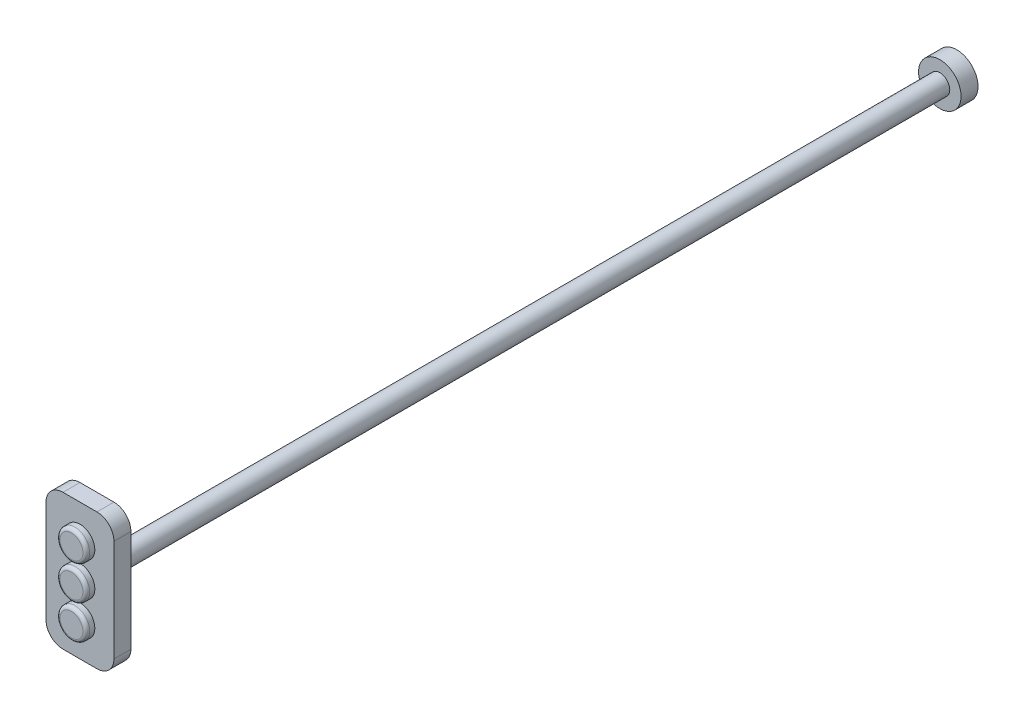
ISO-10303-21;
HEADER;
FILE_DESCRIPTION(('STEP AP214'),'2;1');
FILE_NAME('part.step','',(''),(''),'','','');
FILE_SCHEMA(('AUTOMOTIVE_DESIGN { 1 0 10303 214 1 1 1 1 }'));
ENDSEC;
DATA;
#1=APPLICATION_CONTEXT('core data for automotive mechanical design processes');
#2=APPLICATION_PROTOCOL_DEFINITION('international standard','automotive_design',2000,#1);
#3=PRODUCT_CONTEXT('',#1,'mechanical');
#4=PRODUCT('Part','Part','',(#3));
#5=PRODUCT_RELATED_PRODUCT_CATEGORY('part','',(#4));
#6=PRODUCT_DEFINITION_FORMATION('','',#4);
#7=PRODUCT_DEFINITION_CONTEXT('part definition',#1,'design');
#8=PRODUCT_DEFINITION('design','',#6,#7);
#9=PRODUCT_DEFINITION_SHAPE('','',#8);
#10=(LENGTH_UNIT() NAMED_UNIT(*) SI_UNIT(.MILLI.,.METRE.));
#11=(NAMED_UNIT(*) PLANE_ANGLE_UNIT() SI_UNIT($,.RADIAN.));
#12=(NAMED_UNIT(*) SI_UNIT($,.STERADIAN.) SOLID_ANGLE_UNIT());
#13=UNCERTAINTY_MEASURE_WITH_UNIT(LENGTH_MEASURE(1.E-05),#10,'distance_accuracy_value','');
#14=(GEOMETRIC_REPRESENTATION_CONTEXT(3) GLOBAL_UNCERTAINTY_ASSIGNED_CONTEXT((#13)) GLOBAL_UNIT_ASSIGNED_CONTEXT((#10,
#11,#12)) REPRESENTATION_CONTEXT('',''));
#15=CARTESIAN_POINT('',(0.,0.,0.));
#16=DIRECTION('',(0.,0.,1.));
#17=DIRECTION('',(1.,0.,0.));
#18=AXIS2_PLACEMENT_3D('',#15,#16,#17);
#19=CARTESIAN_POINT('',(0.,0.,511.));
#20=DIRECTION('',(0.,0.,-1.));
#21=DIRECTION('',(-1.,0.,0.));
#22=AXIS2_PLACEMENT_3D('',#19,#20,#21);
#23=CYLINDRICAL_SURFACE('',#22,8.75);
#24=CARTESIAN_POINT('',(0.,0.,506.));
#25=DIRECTION('',(0.,0.,1.));
#26=DIRECTION('',(1.,0.,0.));
#27=AXIS2_PLACEMENT_3D('',#24,#25,#26);
#28=CIRCLE('',#27,8.75);
#29=CARTESIAN_POINT('',(8.75,0.,506.));
#30=VERTEX_POINT('',#29);
#31=EDGE_CURVE('E43',#30,#30,#28,.T.);
#32=ORIENTED_EDGE('',*,*,#31,.T.);
#33=EDGE_LOOP('',(#32));
#34=FACE_BOUND('',#33,.T.);
#35=CARTESIAN_POINT('',(0.,0.,509.));
#36=DIRECTION('',(0.,0.,1.));
#37=DIRECTION('',(1.,0.,0.));
#38=AXIS2_PLACEMENT_3D('',#35,#36,#37);
#39=CIRCLE('',#38,8.75);
#40=CARTESIAN_POINT('',(8.75,0.,509.));
#41=VERTEX_POINT('',#40);
#42=EDGE_CURVE('E11',#41,#41,#39,.F.);
#43=ORIENTED_EDGE('',*,*,#42,.T.);
#44=EDGE_LOOP('',(#43));
#45=FACE_BOUND('',#44,.T.);
#46=ADVANCED_FACE('F39',(#34,#45),#23,.T.);
#47=CARTESIAN_POINT('',(0.,0.,511.));
#48=DIRECTION('',(0.,0.,1.));
#49=DIRECTION('',(1.,0.,0.));
#50=AXIS2_PLACEMENT_3D('',#47,#48,#49);
#51=PLANE('',#50);
#52=CARTESIAN_POINT('',(0.,0.,511.));
#53=DIRECTION('',(0.,0.,1.));
#54=DIRECTION('',(1.,0.,0.));
#55=AXIS2_PLACEMENT_3D('',#52,#53,#54);
#56=CIRCLE('',#55,6.75);
#57=CARTESIAN_POINT('',(6.75,0.,511.));
#58=VERTEX_POINT('',#57);
#59=EDGE_CURVE('E50',#58,#58,#56,.T.);
#60=ORIENTED_EDGE('',*,*,#59,.T.);
#61=EDGE_LOOP('',(#60));
#62=FACE_BOUND('',#61,.T.);
#63=ADVANCED_FACE('F202',(#62),#51,.T.);
#64=CARTESIAN_POINT('',(0.,0.,509.));
#65=DIRECTION('',(0.,0.,1.));
#66=DIRECTION('',(1.,0.,0.));
#67=AXIS2_PLACEMENT_3D('',#64,#65,#66);
#68=TOROIDAL_SURFACE('',#67,6.75,2.);
#69=ORIENTED_EDGE('',*,*,#42,.F.);
#70=EDGE_LOOP('',(#69));
#71=FACE_BOUND('',#70,.T.);
#72=ORIENTED_EDGE('',*,*,#59,.F.);
#73=EDGE_LOOP('',(#72));
#74=FACE_BOUND('',#73,.T.);
#75=ADVANCED_FACE('F41',(#71,#74),#68,.T.);
#76=CARTESIAN_POINT('',(-20.,20.,506.));
#77=DIRECTION('',(1.,0.,0.));
#78=DIRECTION('',(0.,0.,-1.));
#79=AXIS2_PLACEMENT_3D('',#76,#77,#78);
#80=PLANE('',#79);
#81=DIRECTION('',(0.,-1.,0.));
#82=VECTOR('',#81,1.);
#83=CARTESIAN_POINT('',(-20.,20.,496.));
#84=LINE('',#83,#82);
#85=CARTESIAN_POINT('',(-20.,30.,496.));
#86=VERTEX_POINT('',#85);
#87=CARTESIAN_POINT('',(-20.,-30.,496.));
#88=VERTEX_POINT('',#87);
#89=EDGE_CURVE('E143',#86,#88,#84,.T.);
#90=ORIENTED_EDGE('',*,*,#89,.T.);
#91=DIRECTION('',(0.,0.,-1.));
#92=VECTOR('',#91,1.);
#93=CARTESIAN_POINT('',(-20.,-30.,506.));
#94=LINE('',#93,#92);
#95=CARTESIAN_POINT('',(-20.,-30.,506.));
#96=VERTEX_POINT('',#95);
#97=EDGE_CURVE('E185',#96,#88,#94,.T.);
#98=ORIENTED_EDGE('',*,*,#97,.F.);
#99=DIRECTION('',(0.,-1.,0.));
#100=VECTOR('',#99,1.);
#101=CARTESIAN_POINT('',(-20.,20.,506.));
#102=LINE('',#101,#100);
#103=CARTESIAN_POINT('',(-20.,30.,506.));
#104=VERTEX_POINT('',#103);
#105=EDGE_CURVE('E166',#104,#96,#102,.T.);
#106=ORIENTED_EDGE('',*,*,#105,.F.);
#107=DIRECTION('',(0.,0.,-1.));
#108=VECTOR('',#107,1.);
#109=CARTESIAN_POINT('',(-20.,30.,506.));
#110=LINE('',#109,#108);
#111=EDGE_CURVE('E139',#104,#86,#110,.T.);
#112=ORIENTED_EDGE('',*,*,#111,.T.);
#113=EDGE_LOOP('',(#90,#98,#106,#112));
#114=FACE_BOUND('',#113,.T.);
#115=ADVANCED_FACE('F205',(#114),#80,.F.);
#116=CARTESIAN_POINT('',(-10.,-30.,506.));
#117=DIRECTION('',(0.,0.,-1.));
#118=DIRECTION('',(-1.,0.,0.));
#119=AXIS2_PLACEMENT_3D('',#116,#117,#118);
#120=CYLINDRICAL_SURFACE('',#119,10.);
#121=CARTESIAN_POINT('',(-10.,-30.,496.));
#122=DIRECTION('',(0.,0.,1.));
#123=DIRECTION('',(1.,0.,0.));
#124=AXIS2_PLACEMENT_3D('',#121,#122,#123);
#125=CIRCLE('',#124,10.);
#126=CARTESIAN_POINT('',(-10.,-40.,496.));
#127=VERTEX_POINT('',#126);
#128=EDGE_CURVE('E147',#88,#127,#125,.T.);
#129=ORIENTED_EDGE('',*,*,#128,.T.);
#130=DIRECTION('',(0.,0.,-1.));
#131=VECTOR('',#130,1.);
#132=CARTESIAN_POINT('',(-10.,-40.,506.));
#133=LINE('',#132,#131);
#134=CARTESIAN_POINT('',(-10.,-40.,506.));
#135=VERTEX_POINT('',#134);
#136=EDGE_CURVE('E181',#135,#127,#133,.T.);
#137=ORIENTED_EDGE('',*,*,#136,.F.);
#138=CARTESIAN_POINT('',(-10.,-30.,506.));
#139=DIRECTION('',(0.,0.,1.));
#140=DIRECTION('',(1.,0.,0.));
#141=AXIS2_PLACEMENT_3D('',#138,#139,#140);
#142=CIRCLE('',#141,10.);
#143=EDGE_CURVE('E102',#96,#135,#142,.T.);
#144=ORIENTED_EDGE('',*,*,#143,.F.);
#145=ORIENTED_EDGE('',*,*,#97,.T.);
#146=EDGE_LOOP('',(#129,#137,#144,#145));
#147=FACE_BOUND('',#146,.T.);
#148=ADVANCED_FACE('F211',(#147),#120,.T.);
#149=CARTESIAN_POINT('',(0.,-40.,506.));
#150=DIRECTION('',(0.,1.,0.));
#151=DIRECTION('',(0.,0.,1.));
#152=AXIS2_PLACEMENT_3D('',#149,#150,#151);
#153=PLANE('',#152);
#154=DIRECTION('',(1.,0.,0.));
#155=VECTOR('',#154,1.);
#156=CARTESIAN_POINT('',(0.,-40.,496.));
#157=LINE('',#156,#155);
#158=CARTESIAN_POINT('',(10.,-40.,496.));
#159=VERTEX_POINT('',#158);
#160=EDGE_CURVE('E151',#127,#159,#157,.T.);
#161=ORIENTED_EDGE('',*,*,#160,.T.);
#162=DIRECTION('',(0.,0.,-1.));
#163=VECTOR('',#162,1.);
#164=CARTESIAN_POINT('',(10.,-40.,506.));
#165=LINE('',#164,#163);
#166=CARTESIAN_POINT('',(10.,-40.,506.));
#167=VERTEX_POINT('',#166);
#168=EDGE_CURVE('E177',#167,#159,#165,.T.);
#169=ORIENTED_EDGE('',*,*,#168,.F.);
#170=DIRECTION('',(1.,0.,0.));
#171=VECTOR('',#170,1.);
#172=CARTESIAN_POINT('',(0.,-40.,506.));
#173=LINE('',#172,#171);
#174=EDGE_CURVE('E272',#135,#167,#173,.T.);
#175=ORIENTED_EDGE('',*,*,#174,.F.);
#176=ORIENTED_EDGE('',*,*,#136,.T.);
#177=EDGE_LOOP('',(#161,#169,#175,#176));
#178=FACE_BOUND('',#177,.T.);
#179=ADVANCED_FACE('F262',(#178),#153,.F.);
#180=CARTESIAN_POINT('',(10.,-30.,506.));
#181=DIRECTION('',(0.,0.,-1.));
#182=DIRECTION('',(-1.,0.,0.));
#183=AXIS2_PLACEMENT_3D('',#180,#181,#182);
#184=CYLINDRICAL_SURFACE('',#183,10.);
#185=CARTESIAN_POINT('',(10.,-30.,496.));
#186=DIRECTION('',(0.,0.,1.));
#187=DIRECTION('',(1.,0.,0.));
#188=AXIS2_PLACEMENT_3D('',#185,#186,#187);
#189=CIRCLE('',#188,10.);
#190=CARTESIAN_POINT('',(20.,-30.,496.));
#191=VERTEX_POINT('',#190);
#192=EDGE_CURVE('E154',#159,#191,#189,.T.);
#193=ORIENTED_EDGE('',*,*,#192,.T.);
#194=DIRECTION('',(0.,0.,-1.));
#195=VECTOR('',#194,1.);
#196=CARTESIAN_POINT('',(20.,-30.,506.));
#197=LINE('',#196,#195);
#198=CARTESIAN_POINT('',(20.,-30.,506.));
#199=VERTEX_POINT('',#198);
#200=EDGE_CURVE('E173',#199,#191,#197,.T.);
#201=ORIENTED_EDGE('',*,*,#200,.F.);
#202=CARTESIAN_POINT('',(10.,-30.,506.));
#203=DIRECTION('',(0.,0.,1.));
#204=DIRECTION('',(1.,0.,0.));
#205=AXIS2_PLACEMENT_3D('',#202,#203,#204);
#206=CIRCLE('',#205,10.);
#207=EDGE_CURVE('E278',#167,#199,#206,.T.);
#208=ORIENTED_EDGE('',*,*,#207,.F.);
#209=ORIENTED_EDGE('',*,*,#168,.T.);
#210=EDGE_LOOP('',(#193,#201,#208,#209));
#211=FACE_BOUND('',#210,.T.);
#212=ADVANCED_FACE('F258',(#211),#184,.T.);
#213=CARTESIAN_POINT('',(20.,20.,506.));
#214=DIRECTION('',(-1.,0.,0.));
#215=DIRECTION('',(0.,-1.,0.));
#216=AXIS2_PLACEMENT_3D('',#213,#214,#215);
#217=PLANE('',#216);
#218=DIRECTION('',(0.,1.,0.));
#219=VECTOR('',#218,1.);
#220=CARTESIAN_POINT('',(20.,20.,496.));
#221=LINE('',#220,#219);
#222=CARTESIAN_POINT('',(20.,30.,496.));
#223=VERTEX_POINT('',#222);
#224=EDGE_CURVE('E157',#191,#223,#221,.T.);
#225=ORIENTED_EDGE('',*,*,#224,.T.);
#226=DIRECTION('',(0.,0.,-1.));
#227=VECTOR('',#226,1.);
#228=CARTESIAN_POINT('',(20.,30.,506.));
#229=LINE('',#228,#227);
#230=CARTESIAN_POINT('',(20.,30.,506.));
#231=VERTEX_POINT('',#230);
#232=EDGE_CURVE('E132',#231,#223,#229,.T.);
#233=ORIENTED_EDGE('',*,*,#232,.F.);
#234=DIRECTION('',(0.,1.,0.));
#235=VECTOR('',#234,1.);
#236=CARTESIAN_POINT('',(20.,20.,506.));
#237=LINE('',#236,#235);
#238=EDGE_CURVE('E121',#199,#231,#237,.T.);
#239=ORIENTED_EDGE('',*,*,#238,.F.);
#240=ORIENTED_EDGE('',*,*,#200,.T.);
#241=EDGE_LOOP('',(#225,#233,#239,#240));
#242=FACE_BOUND('',#241,.T.);
#243=ADVANCED_FACE('F255',(#242),#217,.F.);
#244=CARTESIAN_POINT('',(10.,30.,506.));
#245=DIRECTION('',(0.,0.,-1.));
#246=DIRECTION('',(-1.,0.,0.));
#247=AXIS2_PLACEMENT_3D('',#244,#245,#246);
#248=CYLINDRICAL_SURFACE('',#247,10.);
#249=CARTESIAN_POINT('',(10.,30.,496.));
#250=DIRECTION('',(0.,0.,1.));
#251=DIRECTION('',(1.,0.,0.));
#252=AXIS2_PLACEMENT_3D('',#249,#250,#251);
#253=CIRCLE('',#252,10.);
#254=CARTESIAN_POINT('',(10.,40.,496.));
#255=VERTEX_POINT('',#254);
#256=EDGE_CURVE('E130',#223,#255,#253,.T.);
#257=ORIENTED_EDGE('',*,*,#256,.T.);
#258=DIRECTION('',(0.,0.,-1.));
#259=VECTOR('',#258,1.);
#260=CARTESIAN_POINT('',(10.,40.,506.));
#261=LINE('',#260,#259);
#262=CARTESIAN_POINT('',(10.,40.,506.));
#263=VERTEX_POINT('',#262);
#264=EDGE_CURVE('E127',#263,#255,#261,.T.);
#265=ORIENTED_EDGE('',*,*,#264,.F.);
#266=CARTESIAN_POINT('',(10.,30.,506.));
#267=DIRECTION('',(0.,0.,1.));
#268=DIRECTION('',(1.,0.,0.));
#269=AXIS2_PLACEMENT_3D('',#266,#267,#268);
#270=CIRCLE('',#269,10.);
#271=EDGE_CURVE('E115',#231,#263,#270,.T.);
#272=ORIENTED_EDGE('',*,*,#271,.F.);
#273=ORIENTED_EDGE('',*,*,#232,.T.);
#274=EDGE_LOOP('',(#257,#265,#272,#273));
#275=FACE_BOUND('',#274,.T.);
#276=ADVANCED_FACE('F128',(#275),#248,.T.);
#277=CARTESIAN_POINT('',(0.,40.,506.));
#278=DIRECTION('',(0.,-1.,0.));
#279=DIRECTION('',(1.,0.,0.));
#280=AXIS2_PLACEMENT_3D('',#277,#278,#279);
#281=PLANE('',#280);
#282=DIRECTION('',(-1.,0.,0.));
#283=VECTOR('',#282,1.);
#284=CARTESIAN_POINT('',(0.,40.,496.));
#285=LINE('',#284,#283);
#286=CARTESIAN_POINT('',(-10.,40.,496.));
#287=VERTEX_POINT('',#286);
#288=EDGE_CURVE('E87',#255,#287,#285,.T.);
#289=ORIENTED_EDGE('',*,*,#288,.T.);
#290=DIRECTION('',(0.,0.,-1.));
#291=VECTOR('',#290,1.);
#292=CARTESIAN_POINT('',(-10.,40.,506.));
#293=LINE('',#292,#291);
#294=CARTESIAN_POINT('',(-10.,40.,506.));
#295=VERTEX_POINT('',#294);
#296=EDGE_CURVE('E133',#295,#287,#293,.T.);
#297=ORIENTED_EDGE('',*,*,#296,.F.);
#298=DIRECTION('',(-1.,0.,0.));
#299=VECTOR('',#298,1.);
#300=CARTESIAN_POINT('',(0.,40.,506.));
#301=LINE('',#300,#299);
#302=EDGE_CURVE('E119',#263,#295,#301,.T.);
#303=ORIENTED_EDGE('',*,*,#302,.F.);
#304=ORIENTED_EDGE('',*,*,#264,.T.);
#305=EDGE_LOOP('',(#289,#297,#303,#304));
#306=FACE_BOUND('',#305,.T.);
#307=ADVANCED_FACE('F135',(#306),#281,.F.);
#308=CARTESIAN_POINT('',(-10.,30.,506.));
#309=DIRECTION('',(0.,0.,-1.));
#310=DIRECTION('',(-1.,0.,0.));
#311=AXIS2_PLACEMENT_3D('',#308,#309,#310);
#312=CYLINDRICAL_SURFACE('',#311,10.);
#313=CARTESIAN_POINT('',(-10.,30.,496.));
#314=DIRECTION('',(0.,0.,1.));
#315=DIRECTION('',(1.,0.,0.));
#316=AXIS2_PLACEMENT_3D('',#313,#314,#315);
#317=CIRCLE('',#316,10.);
#318=EDGE_CURVE('E93',#287,#86,#317,.T.);
#319=ORIENTED_EDGE('',*,*,#318,.T.);
#320=ORIENTED_EDGE('',*,*,#111,.F.);
#321=CARTESIAN_POINT('',(-10.,30.,506.));
#322=DIRECTION('',(0.,0.,1.));
#323=DIRECTION('',(1.,0.,0.));
#324=AXIS2_PLACEMENT_3D('',#321,#322,#323);
#325=CIRCLE('',#324,10.);
#326=EDGE_CURVE('E58',#295,#104,#325,.T.);
#327=ORIENTED_EDGE('',*,*,#326,.F.);
#328=ORIENTED_EDGE('',*,*,#296,.T.);
#329=EDGE_LOOP('',(#319,#320,#327,#328));
#330=FACE_BOUND('',#329,.T.);
#331=ADVANCED_FACE('F234',(#330),#312,.T.);
#332=CARTESIAN_POINT('',(-10.,-30.,506.));
#333=DIRECTION('',(0.,0.,1.));
#334=DIRECTION('',(1.,0.,0.));
#335=AXIS2_PLACEMENT_3D('',#332,#333,#334);
#336=PLANE('',#335);
#337=CARTESIAN_POINT('',(5.58637014214901E-13,-20.,506.));
#338=DIRECTION('',(0.,0.,1.));
#339=DIRECTION('',(1.,0.,0.));
#340=AXIS2_PLACEMENT_3D('',#337,#338,#339);
#341=CIRCLE('',#340,8.75000000000001);
#342=CARTESIAN_POINT('',(8.75000000000056,-20.,506.));
#343=VERTEX_POINT('',#342);
#344=EDGE_CURVE('E299',#343,#343,#341,.F.);
#345=ORIENTED_EDGE('',*,*,#344,.T.);
#346=EDGE_LOOP('',(#345));
#347=FACE_BOUND('',#346,.T.);
#348=CARTESIAN_POINT('',(0.,20.,506.));
#349=DIRECTION('',(0.,0.,1.));
#350=DIRECTION('',(1.,0.,0.));
#351=AXIS2_PLACEMENT_3D('',#348,#349,#350);
#352=CIRCLE('',#351,8.75);
#353=CARTESIAN_POINT('',(8.75,20.,506.));
#354=VERTEX_POINT('',#353);
#355=EDGE_CURVE('E148',#354,#354,#352,.F.);
#356=ORIENTED_EDGE('',*,*,#355,.T.);
#357=EDGE_LOOP('',(#356));
#358=FACE_BOUND('',#357,.T.);
#359=ORIENTED_EDGE('',*,*,#31,.F.);
#360=EDGE_LOOP('',(#359));
#361=FACE_BOUND('',#360,.T.);
#362=ORIENTED_EDGE('',*,*,#105,.T.);
#363=ORIENTED_EDGE('',*,*,#143,.T.);
#364=ORIENTED_EDGE('',*,*,#174,.T.);
#365=ORIENTED_EDGE('',*,*,#207,.T.);
#366=ORIENTED_EDGE('',*,*,#238,.T.);
#367=ORIENTED_EDGE('',*,*,#271,.T.);
#368=ORIENTED_EDGE('',*,*,#302,.T.);
#369=ORIENTED_EDGE('',*,*,#326,.T.);
#370=EDGE_LOOP('',(#362,#363,#364,#365,#366,#367,#368,#369));
#371=FACE_BOUND('',#370,.T.);
#372=ADVANCED_FACE('F117',(#347,#358,#361,#371),#336,.T.);
#373=CARTESIAN_POINT('',(0.,0.,-0.3));
#374=DIRECTION('',(0.,0.,1.));
#375=DIRECTION('',(1.,0.,0.));
#376=AXIS2_PLACEMENT_3D('',#373,#374,#375);
#377=CYLINDRICAL_SURFACE('',#376,5.85);
#378=CARTESIAN_POINT('',(0.,0.,-0.3));
#379=DIRECTION('',(0.,0.,1.));
#380=DIRECTION('',(1.,0.,0.));
#381=AXIS2_PLACEMENT_3D('',#378,#379,#380);
#382=CIRCLE('',#381,5.85);
#383=CARTESIAN_POINT('',(5.85,0.,-0.3));
#384=VERTEX_POINT('',#383);
#385=EDGE_CURVE('E192',#384,#384,#382,.T.);
#386=ORIENTED_EDGE('',*,*,#385,.T.);
#387=EDGE_LOOP('',(#386));
#388=FACE_BOUND('',#387,.T.);
#389=CARTESIAN_POINT('',(0.,0.,496.));
#390=DIRECTION('',(0.,0.,1.));
#391=DIRECTION('',(1.,0.,0.));
#392=AXIS2_PLACEMENT_3D('',#389,#390,#391);
#393=CIRCLE('',#392,5.85);
#394=CARTESIAN_POINT('',(5.85,0.,496.));
#395=VERTEX_POINT('',#394);
#396=EDGE_CURVE('E188',#395,#395,#393,.T.);
#397=ORIENTED_EDGE('',*,*,#396,.F.);
#398=EDGE_LOOP('',(#397));
#399=FACE_BOUND('',#398,.T.);
#400=ADVANCED_FACE('F225',(#388,#399),#377,.T.);
#401=CARTESIAN_POINT('',(0.,0.,496.));
#402=DIRECTION('',(0.,0.,1.));
#403=DIRECTION('',(1.,0.,0.));
#404=AXIS2_PLACEMENT_3D('',#401,#402,#403);
#405=PLANE('',#404);
#406=ORIENTED_EDGE('',*,*,#396,.T.);
#407=EDGE_LOOP('',(#406));
#408=FACE_BOUND('',#407,.T.);
#409=ORIENTED_EDGE('',*,*,#89,.F.);
#410=ORIENTED_EDGE('',*,*,#318,.F.);
#411=ORIENTED_EDGE('',*,*,#288,.F.);
#412=ORIENTED_EDGE('',*,*,#256,.F.);
#413=ORIENTED_EDGE('',*,*,#224,.F.);
#414=ORIENTED_EDGE('',*,*,#192,.F.);
#415=ORIENTED_EDGE('',*,*,#160,.F.);
#416=ORIENTED_EDGE('',*,*,#128,.F.);
#417=EDGE_LOOP('',(#409,#410,#411,#412,#413,#414,#415,#416));
#418=FACE_BOUND('',#417,.T.);
#419=ADVANCED_FACE('F224',(#408,#418),#405,.F.);
#420=CARTESIAN_POINT('',(0.,20.,511.));
#421=DIRECTION('',(0.,0.,-1.));
#422=DIRECTION('',(-1.,0.,0.));
#423=AXIS2_PLACEMENT_3D('',#420,#421,#422);
#424=CYLINDRICAL_SURFACE('',#423,8.75);
#425=ORIENTED_EDGE('',*,*,#355,.F.);
#426=EDGE_LOOP('',(#425));
#427=FACE_BOUND('',#426,.T.);
#428=CARTESIAN_POINT('',(0.,20.,509.));
#429=DIRECTION('',(0.,0.,1.));
#430=DIRECTION('',(1.,0.,0.));
#431=AXIS2_PLACEMENT_3D('',#428,#429,#430);
#432=CIRCLE('',#431,8.75);
#433=CARTESIAN_POINT('',(8.75,20.,509.));
#434=VERTEX_POINT('',#433);
#435=EDGE_CURVE('E291',#434,#434,#432,.F.);
#436=ORIENTED_EDGE('',*,*,#435,.T.);
#437=EDGE_LOOP('',(#436));
#438=FACE_BOUND('',#437,.T.);
#439=ADVANCED_FACE('F232',(#427,#438),#424,.T.);
#440=CARTESIAN_POINT('',(0.,20.,511.));
#441=DIRECTION('',(0.,0.,1.));
#442=DIRECTION('',(1.,0.,0.));
#443=AXIS2_PLACEMENT_3D('',#440,#441,#442);
#444=PLANE('',#443);
#445=CARTESIAN_POINT('',(0.,20.,511.));
#446=DIRECTION('',(0.,0.,1.));
#447=DIRECTION('',(1.,0.,0.));
#448=AXIS2_PLACEMENT_3D('',#445,#446,#447);
#449=CIRCLE('',#448,6.75);
#450=CARTESIAN_POINT('',(6.75,20.,511.));
#451=VERTEX_POINT('',#450);
#452=EDGE_CURVE('E295',#451,#451,#449,.T.);
#453=ORIENTED_EDGE('',*,*,#452,.T.);
#454=EDGE_LOOP('',(#453));
#455=FACE_BOUND('',#454,.T.);
#456=ADVANCED_FACE('F348',(#455),#444,.T.);
#457=CARTESIAN_POINT('',(0.,20.,509.));
#458=DIRECTION('',(0.,0.,1.));
#459=DIRECTION('',(1.,0.,0.));
#460=AXIS2_PLACEMENT_3D('',#457,#458,#459);
#461=TOROIDAL_SURFACE('',#460,6.75,2.);
#462=ORIENTED_EDGE('',*,*,#435,.F.);
#463=EDGE_LOOP('',(#462));
#464=FACE_BOUND('',#463,.T.);
#465=ORIENTED_EDGE('',*,*,#452,.F.);
#466=EDGE_LOOP('',(#465));
#467=FACE_BOUND('',#466,.T.);
#468=ADVANCED_FACE('F343',(#464,#467),#461,.T.);
#469=CARTESIAN_POINT('',(5.58637014214901E-13,-20.,511.));
#470=DIRECTION('',(0.,0.,-1.));
#471=DIRECTION('',(-1.,0.,0.));
#472=AXIS2_PLACEMENT_3D('',#469,#470,#471);
#473=CYLINDRICAL_SURFACE('',#472,8.75000000000001);
#474=ORIENTED_EDGE('',*,*,#344,.F.);
#475=EDGE_LOOP('',(#474));
#476=FACE_BOUND('',#475,.T.);
#477=CARTESIAN_POINT('',(5.58637014214901E-13,-20.,509.));
#478=DIRECTION('',(0.,0.,1.));
#479=DIRECTION('',(1.,0.,0.));
#480=AXIS2_PLACEMENT_3D('',#477,#478,#479);
#481=CIRCLE('',#480,8.75000000000001);
#482=CARTESIAN_POINT('',(8.75000000000056,-20.,509.));
#483=VERTEX_POINT('',#482);
#484=EDGE_CURVE('E303',#483,#483,#481,.F.);
#485=ORIENTED_EDGE('',*,*,#484,.T.);
#486=EDGE_LOOP('',(#485));
#487=FACE_BOUND('',#486,.T.);
#488=ADVANCED_FACE('F339',(#476,#487),#473,.T.);
#489=CARTESIAN_POINT('',(5.58637014214901E-13,-20.,511.));
#490=DIRECTION('',(0.,0.,1.));
#491=DIRECTION('',(1.,0.,0.));
#492=AXIS2_PLACEMENT_3D('',#489,#490,#491);
#493=PLANE('',#492);
#494=CARTESIAN_POINT('',(5.58637014214901E-13,-20.,511.));
#495=DIRECTION('',(0.,0.,1.));
#496=DIRECTION('',(1.,0.,0.));
#497=AXIS2_PLACEMENT_3D('',#494,#495,#496);
#498=CIRCLE('',#497,6.75000000000001);
#499=CARTESIAN_POINT('',(6.75000000000056,-20.,511.));
#500=VERTEX_POINT('',#499);
#501=EDGE_CURVE('E196',#500,#500,#498,.T.);
#502=ORIENTED_EDGE('',*,*,#501,.T.);
#503=EDGE_LOOP('',(#502));
#504=FACE_BOUND('',#503,.T.);
#505=ADVANCED_FACE('F336',(#504),#493,.T.);
#506=CARTESIAN_POINT('',(5.58637014214901E-13,-20.,509.));
#507=DIRECTION('',(0.,0.,1.));
#508=DIRECTION('',(1.,0.,0.));
#509=AXIS2_PLACEMENT_3D('',#506,#507,#508);
#510=TOROIDAL_SURFACE('',#509,6.75000000000001,2.);
#511=ORIENTED_EDGE('',*,*,#484,.F.);
#512=EDGE_LOOP('',(#511));
#513=FACE_BOUND('',#512,.T.);
#514=ORIENTED_EDGE('',*,*,#501,.F.);
#515=EDGE_LOOP('',(#514));
#516=FACE_BOUND('',#515,.T.);
#517=ADVANCED_FACE('F323',(#513,#516),#510,.T.);
#518=CARTESIAN_POINT('',(0.,0.,-10.3));
#519=DIRECTION('',(0.,0.,1.));
#520=DIRECTION('',(1.,0.,0.));
#521=AXIS2_PLACEMENT_3D('',#518,#519,#520);
#522=CYLINDRICAL_SURFACE('',#521,12.5);
#523=CARTESIAN_POINT('',(0.,0.,-10.3));
#524=DIRECTION('',(0.,0.,-1.));
#525=DIRECTION('',(-1.,0.,0.));
#526=AXIS2_PLACEMENT_3D('',#523,#524,#525);
#527=CIRCLE('',#526,12.5);
#528=CARTESIAN_POINT('',(-12.5,0.,-10.3));
#529=VERTEX_POINT('',#528);
#530=EDGE_CURVE('E197',#529,#529,#527,.T.);
#531=ORIENTED_EDGE('',*,*,#530,.F.);
#532=EDGE_LOOP('',(#531));
#533=FACE_BOUND('',#532,.T.);
#534=CARTESIAN_POINT('',(0.,0.,-0.3));
#535=DIRECTION('',(0.,0.,-1.));
#536=DIRECTION('',(-1.,0.,0.));
#537=AXIS2_PLACEMENT_3D('',#534,#535,#536);
#538=CIRCLE('',#537,12.5);
#539=CARTESIAN_POINT('',(-12.5,0.,-0.3));
#540=VERTEX_POINT('',#539);
#541=EDGE_CURVE('E310',#540,#540,#538,.T.);
#542=ORIENTED_EDGE('',*,*,#541,.T.);
#543=EDGE_LOOP('',(#542));
#544=FACE_BOUND('',#543,.T.);
#545=ADVANCED_FACE('F320',(#533,#544),#522,.T.);
#546=CARTESIAN_POINT('',(0.,0.,-10.3));
#547=DIRECTION('',(0.,0.,-1.));
#548=DIRECTION('',(-1.,0.,0.));
#549=AXIS2_PLACEMENT_3D('',#546,#547,#548);
#550=PLANE('',#549);
#551=ORIENTED_EDGE('',*,*,#530,.T.);
#552=EDGE_LOOP('',(#551));
#553=FACE_BOUND('',#552,.T.);
#554=ADVANCED_FACE('F318',(#553),#550,.T.);
#555=CARTESIAN_POINT('',(0.,0.,-0.3));
#556=DIRECTION('',(0.,0.,-1.));
#557=DIRECTION('',(-1.,0.,0.));
#558=AXIS2_PLACEMENT_3D('',#555,#556,#557);
#559=PLANE('',#558);
#560=ORIENTED_EDGE('',*,*,#385,.F.);
#561=EDGE_LOOP('',(#560));
#562=FACE_BOUND('',#561,.T.);
#563=ORIENTED_EDGE('',*,*,#541,.F.);
#564=EDGE_LOOP('',(#563));
#565=FACE_BOUND('',#564,.T.);
#566=ADVANCED_FACE('F327',(#562,#565),#559,.F.);
#567=CLOSED_SHELL('',(#46,#63,#75,#115,#148,#179,#212,#243,#276,#307,#331,#372,#400,#419,#439,
#456,#468,#488,#505,#517,#545,#554,#566));
#568=MANIFOLD_SOLID_BREP('B2',#567);
#569=ADVANCED_BREP_SHAPE_REPRESENTATION('',(#18,#568),#14);
#570=SHAPE_DEFINITION_REPRESENTATION(#9,#569);
ENDSEC;
END-ISO-10303-21;
